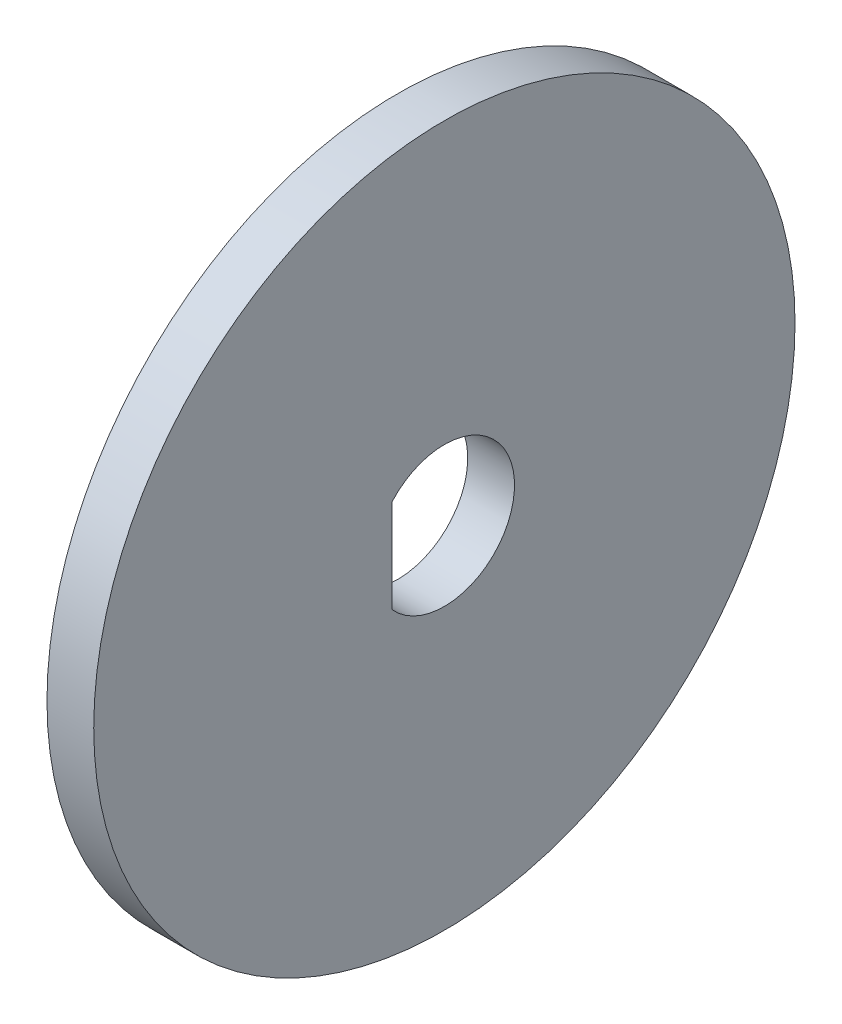
ISO-10303-21;
HEADER;
FILE_DESCRIPTION(('STEP AP214'),'2;1');
FILE_NAME('part.step','',(''),(''),'','','');
FILE_SCHEMA(('AUTOMOTIVE_DESIGN { 1 0 10303 214 1 1 1 1 }'));
ENDSEC;
DATA;
#1=APPLICATION_CONTEXT('core data for automotive mechanical design processes');
#2=APPLICATION_PROTOCOL_DEFINITION('international standard','automotive_design',2000,#1);
#3=PRODUCT_CONTEXT('',#1,'mechanical');
#4=PRODUCT('Part','Part','',(#3));
#5=PRODUCT_RELATED_PRODUCT_CATEGORY('part','',(#4));
#6=PRODUCT_DEFINITION_FORMATION('','',#4);
#7=PRODUCT_DEFINITION_CONTEXT('part definition',#1,'design');
#8=PRODUCT_DEFINITION('design','',#6,#7);
#9=PRODUCT_DEFINITION_SHAPE('','',#8);
#10=(LENGTH_UNIT() NAMED_UNIT(*) SI_UNIT(.MILLI.,.METRE.));
#11=(NAMED_UNIT(*) PLANE_ANGLE_UNIT() SI_UNIT($,.RADIAN.));
#12=(NAMED_UNIT(*) SI_UNIT($,.STERADIAN.) SOLID_ANGLE_UNIT());
#13=UNCERTAINTY_MEASURE_WITH_UNIT(LENGTH_MEASURE(1.E-05),#10,'distance_accuracy_value','');
#14=(GEOMETRIC_REPRESENTATION_CONTEXT(3) GLOBAL_UNCERTAINTY_ASSIGNED_CONTEXT((#13)) GLOBAL_UNIT_ASSIGNED_CONTEXT((#10,
#11,#12)) REPRESENTATION_CONTEXT('',''));
#15=CARTESIAN_POINT('',(0.,0.,0.));
#16=DIRECTION('',(0.,0.,1.));
#17=DIRECTION('',(1.,0.,0.));
#18=AXIS2_PLACEMENT_3D('',#15,#16,#17);
#19=CARTESIAN_POINT('',(2.,0.,0.));
#20=DIRECTION('',(-1.,0.,0.));
#21=DIRECTION('',(0.,0.,1.));
#22=AXIS2_PLACEMENT_3D('',#19,#20,#21);
#23=CYLINDRICAL_SURFACE('',#22,15.);
#24=CARTESIAN_POINT('',(2.,0.,0.));
#25=DIRECTION('',(1.,0.,0.));
#26=DIRECTION('',(0.,0.,-1.));
#27=AXIS2_PLACEMENT_3D('',#24,#25,#26);
#28=CIRCLE('',#27,15.);
#29=CARTESIAN_POINT('',(2.,0.,-15.));
#30=VERTEX_POINT('',#29);
#31=EDGE_CURVE('E11',#30,#30,#28,.T.);
#32=ORIENTED_EDGE('',*,*,#31,.F.);
#33=EDGE_LOOP('',(#32));
#34=FACE_BOUND('',#33,.T.);
#35=CARTESIAN_POINT('',(0.,0.,0.));
#36=DIRECTION('',(1.,0.,0.));
#37=DIRECTION('',(0.,0.,-1.));
#38=AXIS2_PLACEMENT_3D('',#35,#36,#37);
#39=CIRCLE('',#38,15.);
#40=CARTESIAN_POINT('',(0.,0.,-15.));
#41=VERTEX_POINT('',#40);
#42=EDGE_CURVE('E40',#41,#41,#39,.T.);
#43=ORIENTED_EDGE('',*,*,#42,.T.);
#44=EDGE_LOOP('',(#43));
#45=FACE_BOUND('',#44,.T.);
#46=ADVANCED_FACE('F37',(#34,#45),#23,.T.);
#47=CARTESIAN_POINT('',(2.,0.,0.));
#48=DIRECTION('',(1.,0.,0.));
#49=DIRECTION('',(0.,0.,-1.));
#50=AXIS2_PLACEMENT_3D('',#47,#48,#49);
#51=PLANE('',#50);
#52=CARTESIAN_POINT('',(2.,0.,0.));
#53=DIRECTION('',(1.,0.,0.));
#54=DIRECTION('',(0.,0.,-1.));
#55=AXIS2_PLACEMENT_3D('',#52,#53,#54);
#56=CIRCLE('',#55,3.);
#57=CARTESIAN_POINT('',(2.,-2.,2.23606797749979));
#58=VERTEX_POINT('',#57);
#59=CARTESIAN_POINT('',(2.,2.,2.23606797749979));
#60=VERTEX_POINT('',#59);
#61=EDGE_CURVE('E51',#58,#60,#56,.T.);
#62=ORIENTED_EDGE('',*,*,#61,.F.);
#63=DIRECTION('',(0.,-1.,0.));
#64=VECTOR('',#63,1.);
#65=CARTESIAN_POINT('',(2.,2.,2.23606797749979));
#66=LINE('',#65,#64);
#67=EDGE_CURVE('E70',#60,#58,#66,.T.);
#68=ORIENTED_EDGE('',*,*,#67,.F.);
#69=EDGE_LOOP('',(#62,#68));
#70=FACE_BOUND('',#69,.T.);
#71=ORIENTED_EDGE('',*,*,#31,.T.);
#72=EDGE_LOOP('',(#71));
#73=FACE_BOUND('',#72,.T.);
#74=ADVANCED_FACE('F74',(#70,#73),#51,.T.);
#75=CARTESIAN_POINT('',(0.,0.,0.));
#76=DIRECTION('',(1.,0.,0.));
#77=DIRECTION('',(0.,0.,-1.));
#78=AXIS2_PLACEMENT_3D('',#75,#76,#77);
#79=PLANE('',#78);
#80=DIRECTION('',(0.,-1.,0.));
#81=VECTOR('',#80,1.);
#82=CARTESIAN_POINT('',(0.,2.,2.23606797749979));
#83=LINE('',#82,#81);
#84=CARTESIAN_POINT('',(0.,2.,2.23606797749979));
#85=VERTEX_POINT('',#84);
#86=CARTESIAN_POINT('',(0.,-2.,2.23606797749979));
#87=VERTEX_POINT('',#86);
#88=EDGE_CURVE('E78',#85,#87,#83,.T.);
#89=ORIENTED_EDGE('',*,*,#88,.T.);
#90=CARTESIAN_POINT('',(0.,0.,0.));
#91=DIRECTION('',(1.,0.,0.));
#92=DIRECTION('',(0.,0.,-1.));
#93=AXIS2_PLACEMENT_3D('',#90,#91,#92);
#94=CIRCLE('',#93,3.);
#95=EDGE_CURVE('E56',#87,#85,#94,.T.);
#96=ORIENTED_EDGE('',*,*,#95,.T.);
#97=EDGE_LOOP('',(#89,#96));
#98=FACE_BOUND('',#97,.T.);
#99=ORIENTED_EDGE('',*,*,#42,.F.);
#100=EDGE_LOOP('',(#99));
#101=FACE_BOUND('',#100,.T.);
#102=ADVANCED_FACE('F82',(#98,#101),#79,.F.);
#103=CARTESIAN_POINT('',(0.,0.,0.));
#104=DIRECTION('',(1.,0.,0.));
#105=DIRECTION('',(0.,0.,-1.));
#106=AXIS2_PLACEMENT_3D('',#103,#104,#105);
#107=CYLINDRICAL_SURFACE('',#106,3.);
#108=ORIENTED_EDGE('',*,*,#61,.T.);
#109=DIRECTION('',(1.,0.,0.));
#110=VECTOR('',#109,1.);
#111=CARTESIAN_POINT('',(0.,2.,2.23606797749979));
#112=LINE('',#111,#110);
#113=EDGE_CURVE('E67',#85,#60,#112,.T.);
#114=ORIENTED_EDGE('',*,*,#113,.F.);
#115=ORIENTED_EDGE('',*,*,#95,.F.);
#116=DIRECTION('',(1.,0.,0.));
#117=VECTOR('',#116,1.);
#118=CARTESIAN_POINT('',(0.,-2.,2.23606797749979));
#119=LINE('',#118,#117);
#120=EDGE_CURVE('E61',#87,#58,#119,.T.);
#121=ORIENTED_EDGE('',*,*,#120,.T.);
#122=EDGE_LOOP('',(#108,#114,#115,#121));
#123=FACE_BOUND('',#122,.T.);
#124=ADVANCED_FACE('F63',(#123),#107,.F.);
#125=CARTESIAN_POINT('',(0.,2.,2.23606797749979));
#126=DIRECTION('',(0.,0.,1.));
#127=DIRECTION('',(1.,0.,0.));
#128=AXIS2_PLACEMENT_3D('',#125,#126,#127);
#129=PLANE('',#128);
#130=ORIENTED_EDGE('',*,*,#67,.T.);
#131=ORIENTED_EDGE('',*,*,#120,.F.);
#132=ORIENTED_EDGE('',*,*,#88,.F.);
#133=ORIENTED_EDGE('',*,*,#113,.T.);
#134=EDGE_LOOP('',(#130,#131,#132,#133));
#135=FACE_BOUND('',#134,.T.);
#136=ADVANCED_FACE('F71',(#135),#129,.F.);
#137=CLOSED_SHELL('',(#46,#74,#102,#124,#136));
#138=MANIFOLD_SOLID_BREP('B2',#137);
#139=ADVANCED_BREP_SHAPE_REPRESENTATION('',(#18,#138),#14);
#140=SHAPE_DEFINITION_REPRESENTATION(#9,#139);
ENDSEC;
END-ISO-10303-21;
